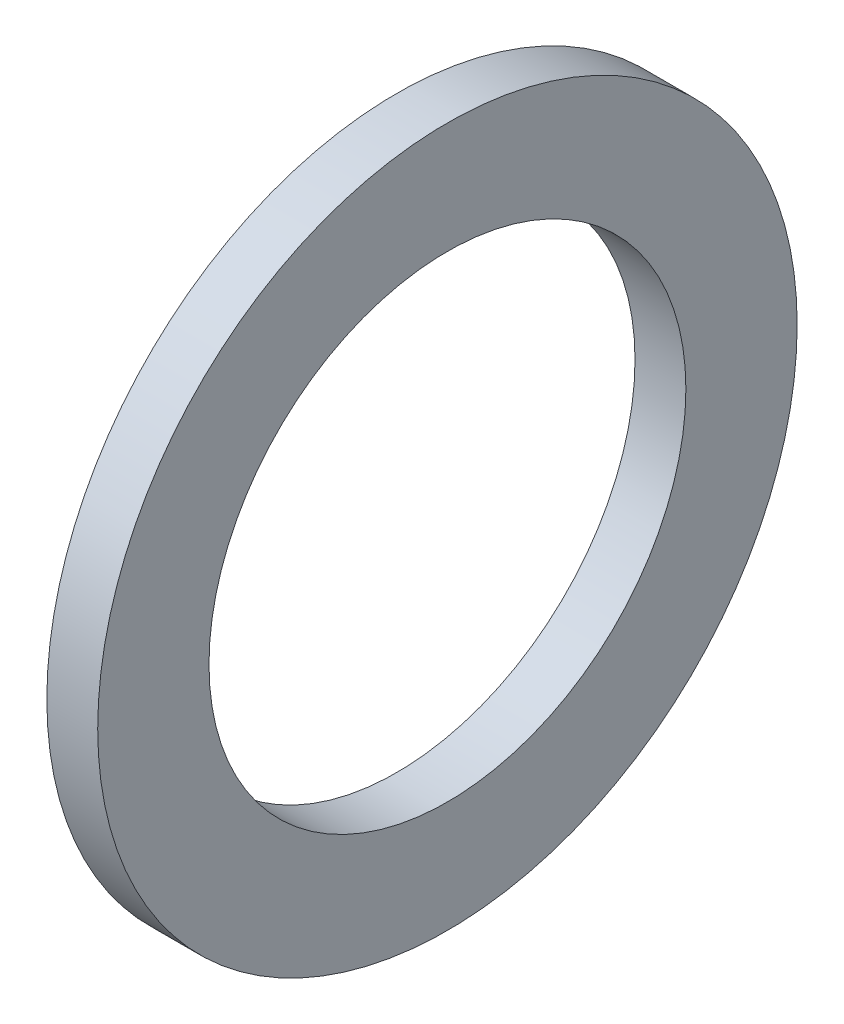
ISO-10303-21;
HEADER;
FILE_DESCRIPTION(('STEP AP214'),'2;1');
FILE_NAME('part.step','',(''),(''),'','','');
FILE_SCHEMA(('AUTOMOTIVE_DESIGN { 1 0 10303 214 1 1 1 1 }'));
ENDSEC;
DATA;
#1=APPLICATION_CONTEXT('core data for automotive mechanical design processes');
#2=APPLICATION_PROTOCOL_DEFINITION('international standard','automotive_design',2000,#1);
#3=PRODUCT_CONTEXT('',#1,'mechanical');
#4=PRODUCT('Part','Part','',(#3));
#5=PRODUCT_RELATED_PRODUCT_CATEGORY('part','',(#4));
#6=PRODUCT_DEFINITION_FORMATION('','',#4);
#7=PRODUCT_DEFINITION_CONTEXT('part definition',#1,'design');
#8=PRODUCT_DEFINITION('design','',#6,#7);
#9=PRODUCT_DEFINITION_SHAPE('','',#8);
#10=(LENGTH_UNIT() NAMED_UNIT(*) SI_UNIT(.MILLI.,.METRE.));
#11=(NAMED_UNIT(*) PLANE_ANGLE_UNIT() SI_UNIT($,.RADIAN.));
#12=(NAMED_UNIT(*) SI_UNIT($,.STERADIAN.) SOLID_ANGLE_UNIT());
#13=UNCERTAINTY_MEASURE_WITH_UNIT(LENGTH_MEASURE(1.E-05),#10,'distance_accuracy_value','');
#14=(GEOMETRIC_REPRESENTATION_CONTEXT(3) GLOBAL_UNCERTAINTY_ASSIGNED_CONTEXT((#13)) GLOBAL_UNIT_ASSIGNED_CONTEXT((#10,
#11,#12)) REPRESENTATION_CONTEXT('',''));
#15=CARTESIAN_POINT('',(0.,0.,0.));
#16=DIRECTION('',(0.,0.,1.));
#17=DIRECTION('',(1.,0.,0.));
#18=AXIS2_PLACEMENT_3D('',#15,#16,#17);
#19=CARTESIAN_POINT('',(1.6,0.,0.));
#20=DIRECTION('',(1.,0.,0.));
#21=DIRECTION('',(0.,0.,-1.));
#22=AXIS2_PLACEMENT_3D('',#19,#20,#21);
#23=PLANE('',#22);
#24=CARTESIAN_POINT('',(1.6,0.,0.));
#25=DIRECTION('',(1.,0.,0.));
#26=DIRECTION('',(0.,0.,-1.));
#27=AXIS2_PLACEMENT_3D('',#24,#25,#26);
#28=CIRCLE('',#27,11.);
#29=CARTESIAN_POINT('',(1.6,0.,-11.));
#30=VERTEX_POINT('',#29);
#31=EDGE_CURVE('E10',#30,#30,#28,.T.);
#32=ORIENTED_EDGE('',*,*,#31,.T.);
#33=EDGE_LOOP('',(#32));
#34=FACE_BOUND('',#33,.T.);
#35=CARTESIAN_POINT('',(1.6,0.,0.));
#36=DIRECTION('',(1.,0.,0.));
#37=DIRECTION('',(0.,0.,-1.));
#38=AXIS2_PLACEMENT_3D('',#35,#36,#37);
#39=CIRCLE('',#38,7.5);
#40=CARTESIAN_POINT('',(1.6,0.,-7.5));
#41=VERTEX_POINT('',#40);
#42=EDGE_CURVE('E41',#41,#41,#39,.T.);
#43=ORIENTED_EDGE('',*,*,#42,.F.);
#44=EDGE_LOOP('',(#43));
#45=FACE_BOUND('',#44,.T.);
#46=ADVANCED_FACE('F30',(#34,#45),#23,.T.);
#47=CARTESIAN_POINT('',(0.,0.,0.));
#48=DIRECTION('',(1.,0.,0.));
#49=DIRECTION('',(0.,0.,-1.));
#50=AXIS2_PLACEMENT_3D('',#47,#48,#49);
#51=PLANE('',#50);
#52=CARTESIAN_POINT('',(0.,0.,0.));
#53=DIRECTION('',(1.,0.,0.));
#54=DIRECTION('',(0.,0.,-1.));
#55=AXIS2_PLACEMENT_3D('',#52,#53,#54);
#56=CIRCLE('',#55,11.);
#57=CARTESIAN_POINT('',(0.,0.,-11.));
#58=VERTEX_POINT('',#57);
#59=EDGE_CURVE('E34',#58,#58,#56,.T.);
#60=ORIENTED_EDGE('',*,*,#59,.F.);
#61=EDGE_LOOP('',(#60));
#62=FACE_BOUND('',#61,.T.);
#63=CARTESIAN_POINT('',(0.,0.,0.));
#64=DIRECTION('',(1.,0.,0.));
#65=DIRECTION('',(0.,0.,-1.));
#66=AXIS2_PLACEMENT_3D('',#63,#64,#65);
#67=CIRCLE('',#66,7.5);
#68=CARTESIAN_POINT('',(0.,0.,-7.5));
#69=VERTEX_POINT('',#68);
#70=EDGE_CURVE('E43',#69,#69,#67,.T.);
#71=ORIENTED_EDGE('',*,*,#70,.T.);
#72=EDGE_LOOP('',(#71));
#73=FACE_BOUND('',#72,.T.);
#74=ADVANCED_FACE('F53',(#62,#73),#51,.F.);
#75=CARTESIAN_POINT('',(1.6,0.,0.));
#76=DIRECTION('',(-1.,0.,0.));
#77=DIRECTION('',(0.,0.,1.));
#78=AXIS2_PLACEMENT_3D('',#75,#76,#77);
#79=CYLINDRICAL_SURFACE('',#78,11.);
#80=ORIENTED_EDGE('',*,*,#31,.F.);
#81=EDGE_LOOP('',(#80));
#82=FACE_BOUND('',#81,.T.);
#83=ORIENTED_EDGE('',*,*,#59,.T.);
#84=EDGE_LOOP('',(#83));
#85=FACE_BOUND('',#84,.T.);
#86=ADVANCED_FACE('F32',(#82,#85),#79,.T.);
#87=CARTESIAN_POINT('',(1.6,0.,0.));
#88=DIRECTION('',(-1.,0.,0.));
#89=DIRECTION('',(0.,0.,1.));
#90=AXIS2_PLACEMENT_3D('',#87,#88,#89);
#91=CYLINDRICAL_SURFACE('',#90,7.5);
#92=ORIENTED_EDGE('',*,*,#42,.T.);
#93=EDGE_LOOP('',(#92));
#94=FACE_BOUND('',#93,.T.);
#95=ORIENTED_EDGE('',*,*,#70,.F.);
#96=EDGE_LOOP('',(#95));
#97=FACE_BOUND('',#96,.T.);
#98=ADVANCED_FACE('F49',(#94,#97),#91,.F.);
#99=CLOSED_SHELL('',(#46,#74,#86,#98));
#100=MANIFOLD_SOLID_BREP('B2',#99);
#101=ADVANCED_BREP_SHAPE_REPRESENTATION('',(#18,#100),#14);
#102=SHAPE_DEFINITION_REPRESENTATION(#9,#101);
ENDSEC;
END-ISO-10303-21;
